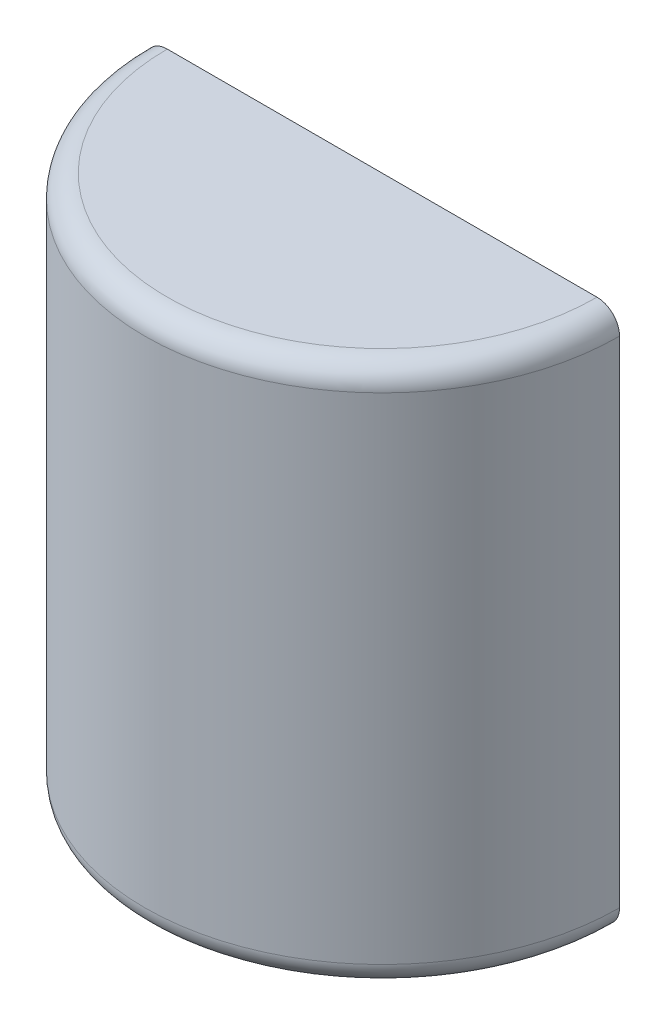
ISO-10303-21;
HEADER;
FILE_DESCRIPTION(('STEP AP214'),'2;1');
FILE_NAME('part.step','',(''),(''),'','','');
FILE_SCHEMA(('AUTOMOTIVE_DESIGN { 1 0 10303 214 1 1 1 1 }'));
ENDSEC;
DATA;
#1=APPLICATION_CONTEXT('core data for automotive mechanical design processes');
#2=APPLICATION_PROTOCOL_DEFINITION('international standard','automotive_design',2000,#1);
#3=PRODUCT_CONTEXT('',#1,'mechanical');
#4=PRODUCT('Part','Part','',(#3));
#5=PRODUCT_RELATED_PRODUCT_CATEGORY('part','',(#4));
#6=PRODUCT_DEFINITION_FORMATION('','',#4);
#7=PRODUCT_DEFINITION_CONTEXT('part definition',#1,'design');
#8=PRODUCT_DEFINITION('design','',#6,#7);
#9=PRODUCT_DEFINITION_SHAPE('','',#8);
#10=(LENGTH_UNIT() NAMED_UNIT(*) SI_UNIT(.MILLI.,.METRE.));
#11=(NAMED_UNIT(*) PLANE_ANGLE_UNIT() SI_UNIT($,.RADIAN.));
#12=(NAMED_UNIT(*) SI_UNIT($,.STERADIAN.) SOLID_ANGLE_UNIT());
#13=UNCERTAINTY_MEASURE_WITH_UNIT(LENGTH_MEASURE(1.E-05),#10,'distance_accuracy_value','');
#14=(GEOMETRIC_REPRESENTATION_CONTEXT(3) GLOBAL_UNCERTAINTY_ASSIGNED_CONTEXT((#13)) GLOBAL_UNIT_ASSIGNED_CONTEXT((#10,
#11,#12)) REPRESENTATION_CONTEXT('',''));
#15=CARTESIAN_POINT('',(0.,0.,0.));
#16=DIRECTION('',(0.,0.,1.));
#17=DIRECTION('',(1.,0.,0.));
#18=AXIS2_PLACEMENT_3D('',#15,#16,#17);
#19=CARTESIAN_POINT('',(0.,304.8,0.));
#20=DIRECTION('',(0.,-1.,0.));
#21=DIRECTION('',(0.,0.,-1.));
#22=AXIS2_PLACEMENT_3D('',#19,#20,#21);
#23=PLANE('',#22);
#24=DIRECTION('',(1.,0.,0.));
#25=VECTOR('',#24,1.);
#26=CARTESIAN_POINT('',(0.,304.8,0.));
#27=LINE('',#26,#25);
#28=CARTESIAN_POINT('',(-121.285,304.8,8.46928628363179E-13));
#29=VERTEX_POINT('',#28);
#30=CARTESIAN_POINT('',(121.285,304.8,-8.46928628363179E-13));
#31=VERTEX_POINT('',#30);
#32=EDGE_CURVE('E103',#29,#31,#27,.T.);
#33=ORIENTED_EDGE('',*,*,#32,.F.);
#34=CARTESIAN_POINT('',(0.,304.8,0.));
#35=DIRECTION('',(0.,-1.,0.));
#36=DIRECTION('',(0.,0.,-1.));
#37=AXIS2_PLACEMENT_3D('',#34,#35,#36);
#38=CIRCLE('',#37,121.285);
#39=EDGE_CURVE('E11',#29,#31,#38,.F.);
#40=ORIENTED_EDGE('',*,*,#39,.T.);
#41=EDGE_LOOP('',(#33,#40));
#42=FACE_BOUND('',#41,.T.);
#43=ADVANCED_FACE('F33',(#42),#23,.F.);
#44=CARTESIAN_POINT('',(0.,0.,0.));
#45=DIRECTION('',(0.,-1.,0.));
#46=DIRECTION('',(0.,0.,-1.));
#47=AXIS2_PLACEMENT_3D('',#44,#45,#46);
#48=CYLINDRICAL_SURFACE('',#47,133.985);
#49=DIRECTION('',(0.,-1.,0.));
#50=VECTOR('',#49,1.);
#51=CARTESIAN_POINT('',(-133.985,0.,0.));
#52=LINE('',#51,#50);
#53=CARTESIAN_POINT('',(-133.985,292.1,0.));
#54=VERTEX_POINT('',#53);
#55=CARTESIAN_POINT('',(-133.985,12.7,0.));
#56=VERTEX_POINT('',#55);
#57=EDGE_CURVE('E100',#54,#56,#52,.T.);
#58=ORIENTED_EDGE('',*,*,#57,.T.);
#59=CARTESIAN_POINT('',(0.,12.7,0.));
#60=DIRECTION('',(0.,1.,0.));
#61=DIRECTION('',(0.,0.,1.));
#62=AXIS2_PLACEMENT_3D('',#59,#60,#61);
#63=CIRCLE('',#62,133.985);
#64=CARTESIAN_POINT('',(133.985,12.7,-9.35612254369794E-13));
#65=VERTEX_POINT('',#64);
#66=EDGE_CURVE('E41',#56,#65,#63,.T.);
#67=ORIENTED_EDGE('',*,*,#66,.T.);
#68=DIRECTION('',(0.,-1.,0.));
#69=VECTOR('',#68,1.);
#70=CARTESIAN_POINT('',(133.985,0.,-9.35612254369794E-13));
#71=LINE('',#70,#69);
#72=CARTESIAN_POINT('',(133.985,292.1,-9.35612254369794E-13));
#73=VERTEX_POINT('',#72);
#74=EDGE_CURVE('E77',#73,#65,#71,.T.);
#75=ORIENTED_EDGE('',*,*,#74,.F.);
#76=CARTESIAN_POINT('',(0.,292.1,0.));
#77=DIRECTION('',(0.,-1.,0.));
#78=DIRECTION('',(0.,0.,-1.));
#79=AXIS2_PLACEMENT_3D('',#76,#77,#78);
#80=CIRCLE('',#79,133.985);
#81=EDGE_CURVE('E95',#73,#54,#80,.T.);
#82=ORIENTED_EDGE('',*,*,#81,.T.);
#83=EDGE_LOOP('',(#58,#67,#75,#82));
#84=FACE_BOUND('',#83,.T.);
#85=ADVANCED_FACE('F99',(#84),#48,.T.);
#86=CARTESIAN_POINT('',(0.,0.,0.));
#87=DIRECTION('',(0.,1.,0.));
#88=DIRECTION('',(0.,0.,1.));
#89=AXIS2_PLACEMENT_3D('',#86,#87,#88);
#90=PLANE('',#89);
#91=DIRECTION('',(-1.,0.,0.));
#92=VECTOR('',#91,1.);
#93=CARTESIAN_POINT('',(0.,0.,0.));
#94=LINE('',#93,#92);
#95=CARTESIAN_POINT('',(121.285,0.,-8.46928628363179E-13));
#96=VERTEX_POINT('',#95);
#97=CARTESIAN_POINT('',(-121.285,0.,8.46928628363179E-13));
#98=VERTEX_POINT('',#97);
#99=EDGE_CURVE('E76',#96,#98,#94,.T.);
#100=ORIENTED_EDGE('',*,*,#99,.F.);
#101=CARTESIAN_POINT('',(0.,0.,0.));
#102=DIRECTION('',(0.,1.,0.));
#103=DIRECTION('',(0.,0.,1.));
#104=AXIS2_PLACEMENT_3D('',#101,#102,#103);
#105=CIRCLE('',#104,121.285);
#106=EDGE_CURVE('E86',#96,#98,#105,.F.);
#107=ORIENTED_EDGE('',*,*,#106,.T.);
#108=EDGE_LOOP('',(#100,#107));
#109=FACE_BOUND('',#108,.T.);
#110=ADVANCED_FACE('F85',(#109),#90,.F.);
#111=CARTESIAN_POINT('',(0.,0.,0.));
#112=DIRECTION('',(0.,0.,-1.));
#113=DIRECTION('',(-1.,0.,0.));
#114=AXIS2_PLACEMENT_3D('',#111,#112,#113);
#115=PLANE('',#114);
#116=ORIENTED_EDGE('',*,*,#99,.T.);
#117=CARTESIAN_POINT('',(-121.285,12.7,8.46928628363179E-13));
#118=DIRECTION('',(0.,0.,-1.));
#119=DIRECTION('',(-1.,0.,0.));
#120=AXIS2_PLACEMENT_3D('',#117,#118,#119);
#121=CIRCLE('',#120,12.7);
#122=EDGE_CURVE('E80',#98,#56,#121,.T.);
#123=ORIENTED_EDGE('',*,*,#122,.T.);
#124=ORIENTED_EDGE('',*,*,#57,.F.);
#125=CARTESIAN_POINT('',(-121.285,292.1,8.46928628363179E-13));
#126=DIRECTION('',(0.,0.,-1.));
#127=DIRECTION('',(-1.,0.,0.));
#128=AXIS2_PLACEMENT_3D('',#125,#126,#127);
#129=CIRCLE('',#128,12.7);
#130=EDGE_CURVE('E81',#54,#29,#129,.T.);
#131=ORIENTED_EDGE('',*,*,#130,.T.);
#132=ORIENTED_EDGE('',*,*,#32,.T.);
#133=CARTESIAN_POINT('',(121.285,292.1,-8.46928628363179E-13));
#134=DIRECTION('',(0.,0.,-1.));
#135=DIRECTION('',(-1.,0.,0.));
#136=AXIS2_PLACEMENT_3D('',#133,#134,#135);
#137=CIRCLE('',#136,12.7);
#138=EDGE_CURVE('E54',#31,#73,#137,.T.);
#139=ORIENTED_EDGE('',*,*,#138,.T.);
#140=ORIENTED_EDGE('',*,*,#74,.T.);
#141=CARTESIAN_POINT('',(121.285,12.7,-8.46928628363179E-13));
#142=DIRECTION('',(0.,0.,-1.));
#143=DIRECTION('',(-1.,0.,0.));
#144=AXIS2_PLACEMENT_3D('',#141,#142,#143);
#145=CIRCLE('',#144,12.7);
#146=EDGE_CURVE('E73',#65,#96,#145,.T.);
#147=ORIENTED_EDGE('',*,*,#146,.T.);
#148=EDGE_LOOP('',(#116,#123,#124,#131,#132,#139,#140,#147));
#149=FACE_BOUND('',#148,.T.);
#150=ADVANCED_FACE('F75',(#149),#115,.T.);
#151=CARTESIAN_POINT('',(0.,12.7,0.));
#152=DIRECTION('',(0.,1.,0.));
#153=DIRECTION('',(0.,0.,1.));
#154=AXIS2_PLACEMENT_3D('',#151,#152,#153);
#155=TOROIDAL_SURFACE('',#154,121.285,12.7);
#156=ORIENTED_EDGE('',*,*,#146,.F.);
#157=ORIENTED_EDGE('',*,*,#66,.F.);
#158=ORIENTED_EDGE('',*,*,#122,.F.);
#159=ORIENTED_EDGE('',*,*,#106,.F.);
#160=EDGE_LOOP('',(#156,#157,#158,#159));
#161=FACE_BOUND('',#160,.T.);
#162=ADVANCED_FACE('F88',(#161),#155,.T.);
#163=CARTESIAN_POINT('',(0.,292.1,0.));
#164=DIRECTION('',(0.,-1.,0.));
#165=DIRECTION('',(0.,0.,-1.));
#166=AXIS2_PLACEMENT_3D('',#163,#164,#165);
#167=TOROIDAL_SURFACE('',#166,121.285,12.7);
#168=ORIENTED_EDGE('',*,*,#138,.F.);
#169=ORIENTED_EDGE('',*,*,#39,.F.);
#170=ORIENTED_EDGE('',*,*,#130,.F.);
#171=ORIENTED_EDGE('',*,*,#81,.F.);
#172=EDGE_LOOP('',(#168,#169,#170,#171));
#173=FACE_BOUND('',#172,.T.);
#174=ADVANCED_FACE('F35',(#173),#167,.T.);
#175=CLOSED_SHELL('',(#43,#85,#110,#150,#162,#174));
#176=MANIFOLD_SOLID_BREP('B2',#175);
#177=ADVANCED_BREP_SHAPE_REPRESENTATION('',(#18,#176),#14);
#178=SHAPE_DEFINITION_REPRESENTATION(#9,#177);
ENDSEC;
END-ISO-10303-21;
